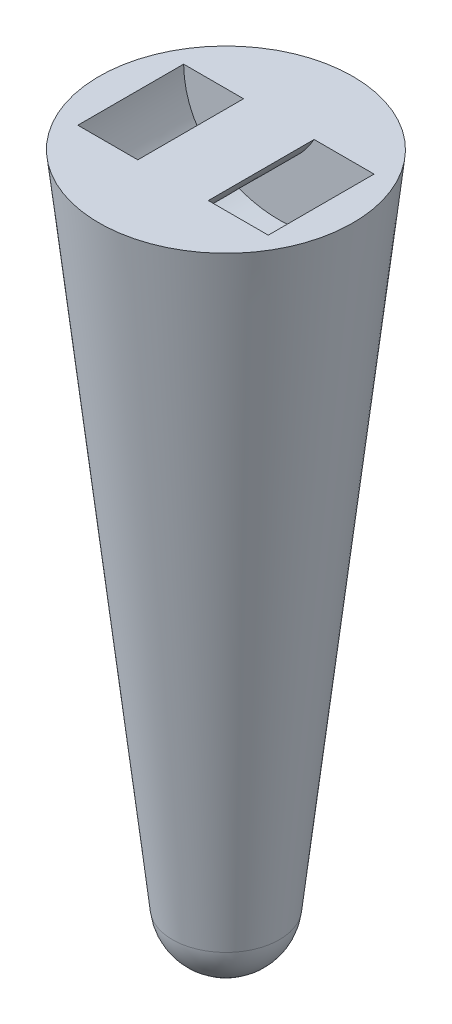
ISO-10303-21;
HEADER;
FILE_DESCRIPTION(('STEP AP214'),'2;1');
FILE_NAME('part.step','',(''),(''),'','','');
FILE_SCHEMA(('AUTOMOTIVE_DESIGN { 1 0 10303 214 1 1 1 1 }'));
ENDSEC;
DATA;
#1=APPLICATION_CONTEXT('core data for automotive mechanical design processes');
#2=APPLICATION_PROTOCOL_DEFINITION('international standard','automotive_design',2000,#1);
#3=PRODUCT_CONTEXT('',#1,'mechanical');
#4=PRODUCT('Part','Part','',(#3));
#5=PRODUCT_RELATED_PRODUCT_CATEGORY('part','',(#4));
#6=PRODUCT_DEFINITION_FORMATION('','',#4);
#7=PRODUCT_DEFINITION_CONTEXT('part definition',#1,'design');
#8=PRODUCT_DEFINITION('design','',#6,#7);
#9=PRODUCT_DEFINITION_SHAPE('','',#8);
#10=(LENGTH_UNIT() NAMED_UNIT(*) SI_UNIT(.MILLI.,.METRE.));
#11=(NAMED_UNIT(*) PLANE_ANGLE_UNIT() SI_UNIT($,.RADIAN.));
#12=(NAMED_UNIT(*) SI_UNIT($,.STERADIAN.) SOLID_ANGLE_UNIT());
#13=UNCERTAINTY_MEASURE_WITH_UNIT(LENGTH_MEASURE(1.E-05),#10,'distance_accuracy_value','');
#14=(GEOMETRIC_REPRESENTATION_CONTEXT(3) GLOBAL_UNCERTAINTY_ASSIGNED_CONTEXT((#13)) GLOBAL_UNIT_ASSIGNED_CONTEXT((#10,
#11,#12)) REPRESENTATION_CONTEXT('',''));
#15=CARTESIAN_POINT('',(0.,0.,0.));
#16=DIRECTION('',(0.,0.,1.));
#17=DIRECTION('',(1.,0.,0.));
#18=AXIS2_PLACEMENT_3D('',#15,#16,#17);
#19=CARTESIAN_POINT('',(-2.66598740101734E-06,102.893547445503,12.));
#20=DIRECTION('',(0.,0.,-1.));
#21=DIRECTION('',(-1.,0.,0.));
#22=AXIS2_PLACEMENT_3D('',#19,#20,#21);
#23=PLANE('',#22);
#24=DIRECTION('',(-1.,0.,0.));
#25=VECTOR('',#24,1.);
#26=CARTESIAN_POINT('',(-21.6000026659874,122.668496646552,12.));
#27=LINE('',#26,#25);
#28=CARTESIAN_POINT('',(-8.0000026659874,122.668496646552,12.));
#29=VERTEX_POINT('',#28);
#30=CARTESIAN_POINT('',(-21.6000026659874,122.668496646552,12.));
#31=VERTEX_POINT('',#30);
#32=EDGE_CURVE('E90',#29,#31,#27,.T.);
#33=ORIENTED_EDGE('',*,*,#32,.F.);
#34=CARTESIAN_POINT('',(-8.0000026659874,122.668496646552,12.));
#35=CARTESIAN_POINT('',(-2.66598740353269E-06,109.065693162065,12.));
#36=CARTESIAN_POINT('',(7.99999733401259,122.668496646552,12.));
#37=B_SPLINE_CURVE_WITH_KNOTS('',2,(#34,#35,#36),.UNSPECIFIED.,.F.,.F.,(3,3),(0.,1.),.UNSPECIFIED.);
#38=CARTESIAN_POINT('',(7.99999733401259,122.668496646552,12.));
#39=VERTEX_POINT('',#38);
#40=EDGE_CURVE('E80',#39,#29,#37,.F.);
#41=ORIENTED_EDGE('',*,*,#40,.F.);
#42=CARTESIAN_POINT('',(21.5999973340126,122.668496646552,12.));
#43=VERTEX_POINT('',#42);
#44=EDGE_CURVE('E88',#43,#39,#27,.T.);
#45=ORIENTED_EDGE('',*,*,#44,.F.);
#46=CARTESIAN_POINT('',(-21.6000026659874,122.668496646552,12.));
#47=CARTESIAN_POINT('',(-21.2657843312671,96.3018977118197,12.));
#48=CARTESIAN_POINT('',(21.2657789992923,96.3018977118198,12.));
#49=CARTESIAN_POINT('',(21.5999973340126,122.668496646552,12.));
#50=B_SPLINE_CURVE_WITH_KNOTS('',3,(#46,#47,#48,#49),.UNSPECIFIED.,.F.,.F.,(4,4),(0.,1.),.UNSPECIFIED.);
#51=EDGE_CURVE('E100',#31,#43,#50,.T.);
#52=ORIENTED_EDGE('',*,*,#51,.F.);
#53=EDGE_LOOP('',(#33,#41,#45,#52));
#54=FACE_BOUND('',#53,.T.);
#55=ADVANCED_FACE('F36',(#54),#23,.T.);
#56=CARTESIAN_POINT('',(-2.66598740101734E-06,102.893547445503,-12.));
#57=DIRECTION('',(0.,0.,-1.));
#58=DIRECTION('',(-1.,0.,0.));
#59=AXIS2_PLACEMENT_3D('',#56,#57,#58);
#60=PLANE('',#59);
#61=CARTESIAN_POINT('',(-8.0000026659874,122.668496646552,-12.));
#62=CARTESIAN_POINT('',(-2.66598740353269E-06,109.065693162065,-12.));
#63=CARTESIAN_POINT('',(7.99999733401259,122.668496646552,-12.));
#64=B_SPLINE_CURVE_WITH_KNOTS('',2,(#61,#62,#63),.UNSPECIFIED.,.F.,.F.,(3,3),(0.,1.),.UNSPECIFIED.);
#65=CARTESIAN_POINT('',(-8.0000026659874,122.668496646552,-12.));
#66=VERTEX_POINT('',#65);
#67=CARTESIAN_POINT('',(7.99999733401259,122.668496646552,-12.));
#68=VERTEX_POINT('',#67);
#69=EDGE_CURVE('E82',#66,#68,#64,.T.);
#70=ORIENTED_EDGE('',*,*,#69,.F.);
#71=DIRECTION('',(-1.,0.,0.));
#72=VECTOR('',#71,1.);
#73=CARTESIAN_POINT('',(-21.6000026659874,122.668496646552,-12.));
#74=LINE('',#73,#72);
#75=CARTESIAN_POINT('',(-21.6000026659874,122.668496646552,-12.));
#76=VERTEX_POINT('',#75);
#77=EDGE_CURVE('E138',#66,#76,#74,.T.);
#78=ORIENTED_EDGE('',*,*,#77,.T.);
#79=CARTESIAN_POINT('',(-21.6000026659874,122.668496646552,-12.));
#80=CARTESIAN_POINT('',(-21.2657843312671,96.3018977118197,-12.));
#81=CARTESIAN_POINT('',(21.2657789992923,96.3018977118198,-12.));
#82=CARTESIAN_POINT('',(21.5999973340126,122.668496646552,-12.));
#83=B_SPLINE_CURVE_WITH_KNOTS('',3,(#79,#80,#81,#82),.UNSPECIFIED.,.F.,.F.,(4,4),(0.,1.),.UNSPECIFIED.);
#84=CARTESIAN_POINT('',(21.5999973340126,122.668496646552,-12.));
#85=VERTEX_POINT('',#84);
#86=EDGE_CURVE('E137',#76,#85,#83,.T.);
#87=ORIENTED_EDGE('',*,*,#86,.T.);
#88=EDGE_CURVE('E59',#85,#68,#74,.T.);
#89=ORIENTED_EDGE('',*,*,#88,.T.);
#90=EDGE_LOOP('',(#70,#78,#87,#89));
#91=FACE_BOUND('',#90,.T.);
#92=ADVANCED_FACE('F113',(#91),#60,.F.);
#93=CARTESIAN_POINT('',(-2.66598740101734E-06,122.668496646552,0.));
#94=DIRECTION('',(0.,-1.,0.));
#95=DIRECTION('',(0.,0.,-1.));
#96=AXIS2_PLACEMENT_3D('',#93,#94,#95);
#97=PLANE('',#96);
#98=DIRECTION('',(0.,0.,-1.));
#99=VECTOR('',#98,1.);
#100=CARTESIAN_POINT('',(-8.0000026659874,122.668496646552,28.8032));
#101=LINE('',#100,#99);
#102=EDGE_CURVE('E51',#29,#66,#101,.T.);
#103=ORIENTED_EDGE('',*,*,#102,.F.);
#104=ORIENTED_EDGE('',*,*,#32,.T.);
#105=DIRECTION('',(0.,0.,-1.));
#106=VECTOR('',#105,1.);
#107=CARTESIAN_POINT('',(-21.6000026659874,122.668496646552,12.));
#108=LINE('',#107,#106);
#109=EDGE_CURVE('E96',#31,#76,#108,.T.);
#110=ORIENTED_EDGE('',*,*,#109,.T.);
#111=ORIENTED_EDGE('',*,*,#77,.F.);
#112=EDGE_LOOP('',(#103,#104,#110,#111));
#113=FACE_BOUND('',#112,.T.);
#114=CARTESIAN_POINT('',(-2.66598740101734E-06,122.668496646552,0.));
#115=DIRECTION('',(0.,-1.,0.));
#116=DIRECTION('',(0.,0.,-1.));
#117=AXIS2_PLACEMENT_3D('',#114,#115,#116);
#118=CIRCLE('',#117,28.8);
#119=CARTESIAN_POINT('',(-2.66598740101734E-06,122.668496646552,-28.8));
#120=VERTEX_POINT('',#119);
#121=EDGE_CURVE('E44',#120,#120,#118,.T.);
#122=ORIENTED_EDGE('',*,*,#121,.F.);
#123=EDGE_LOOP('',(#122));
#124=FACE_BOUND('',#123,.T.);
#125=ORIENTED_EDGE('',*,*,#44,.T.);
#126=DIRECTION('',(0.,0.,-1.));
#127=VECTOR('',#126,1.);
#128=CARTESIAN_POINT('',(7.99999733401259,122.668496646552,28.8032));
#129=LINE('',#128,#127);
#130=EDGE_CURVE('E77',#39,#68,#129,.T.);
#131=ORIENTED_EDGE('',*,*,#130,.T.);
#132=ORIENTED_EDGE('',*,*,#88,.F.);
#133=DIRECTION('',(0.,0.,-1.));
#134=VECTOR('',#133,1.);
#135=CARTESIAN_POINT('',(21.5999973340126,122.668496646552,12.));
#136=LINE('',#135,#134);
#137=EDGE_CURVE('E95',#43,#85,#136,.T.);
#138=ORIENTED_EDGE('',*,*,#137,.F.);
#139=EDGE_LOOP('',(#125,#131,#132,#138));
#140=FACE_BOUND('',#139,.T.);
#141=ADVANCED_FACE('F93',(#113,#124,#140),#97,.F.);
#142=CARTESIAN_POINT('',(-2.66598740101734E-06,-25.1071984423993,0.));
#143=DIRECTION('',(0.,-1.,0.));
#144=DIRECTION('',(-1.,0.,0.));
#145=AXIS2_PLACEMENT_3D('',#142,#143,#144);
#146=SPHERICAL_SURFACE('',#145,12.2243049110484);
#147=CARTESIAN_POINT('',(-2.66598740101734E-06,-26.4636607740346,0.));
#148=DIRECTION('',(0.,-1.,0.));
#149=DIRECTION('',(0.,0.,-1.));
#150=AXIS2_PLACEMENT_3D('',#147,#148,#149);
#151=CIRCLE('',#150,12.1488123082521);
#152=CARTESIAN_POINT('',(-2.66598740101734E-06,-26.4636607740346,-12.1488123082521));
#153=VERTEX_POINT('',#152);
#154=EDGE_CURVE('E11',#153,#153,#151,.T.);
#155=ORIENTED_EDGE('',*,*,#154,.T.);
#156=EDGE_LOOP('',(#155));
#157=FACE_BOUND('',#156,.T.);
#158=ADVANCED_FACE('F38',(#157),#146,.T.);
#159=CARTESIAN_POINT('',(-2.66598740101734E-06,122.668496646552,0.));
#160=DIRECTION('',(0.,1.,0.));
#161=DIRECTION('',(0.,0.,1.));
#162=AXIS2_PLACEMENT_3D('',#159,#160,#161);
#163=CONICAL_SURFACE('',#162,28.8,0.111193363332835);
#164=ORIENTED_EDGE('',*,*,#154,.F.);
#165=EDGE_LOOP('',(#164));
#166=FACE_BOUND('',#165,.T.);
#167=ORIENTED_EDGE('',*,*,#121,.T.);
#168=EDGE_LOOP('',(#167));
#169=FACE_BOUND('',#168,.T.);
#170=ADVANCED_FACE('F110',(#166,#169),#163,.T.);
#171=DIRECTION('',(0.,0.,-1.));
#172=VECTOR('',#171,1.);
#173=SURFACE_OF_LINEAR_EXTRUSION('',#50,#172);
#174=ORIENTED_EDGE('',*,*,#109,.F.);
#175=ORIENTED_EDGE('',*,*,#51,.T.);
#176=ORIENTED_EDGE('',*,*,#137,.T.);
#177=ORIENTED_EDGE('',*,*,#86,.F.);
#178=EDGE_LOOP('',(#174,#175,#176,#177));
#179=FACE_BOUND('',#178,.T.);
#180=ADVANCED_FACE('F127',(#179),#173,.T.);
#181=CARTESIAN_POINT('',(-8.0000026659874,122.668496646552,28.8032));
#182=CARTESIAN_POINT('',(-2.66598740353269E-06,109.065693162065,28.8032));
#183=CARTESIAN_POINT('',(7.99999733401259,122.668496646552,28.8032));
#184=B_SPLINE_CURVE_WITH_KNOTS('',2,(#181,#182,#183),.UNSPECIFIED.,.F.,.F.,(3,3),(0.,1.),.UNSPECIFIED.);
#185=DIRECTION('',(0.,0.,-1.));
#186=VECTOR('',#185,1.);
#187=SURFACE_OF_LINEAR_EXTRUSION('',#184,#186);
#188=ORIENTED_EDGE('',*,*,#130,.F.);
#189=ORIENTED_EDGE('',*,*,#40,.T.);
#190=ORIENTED_EDGE('',*,*,#102,.T.);
#191=ORIENTED_EDGE('',*,*,#69,.T.);
#192=EDGE_LOOP('',(#188,#189,#190,#191));
#193=FACE_BOUND('',#192,.T.);
#194=ADVANCED_FACE('F79',(#193),#187,.F.);
#195=CLOSED_SHELL('',(#55,#92,#141,#158,#170,#180,#194));
#196=MANIFOLD_SOLID_BREP('B2',#195);
#197=ADVANCED_BREP_SHAPE_REPRESENTATION('',(#18,#196),#14);
#198=SHAPE_DEFINITION_REPRESENTATION(#9,#197);
ENDSEC;
END-ISO-10303-21;
